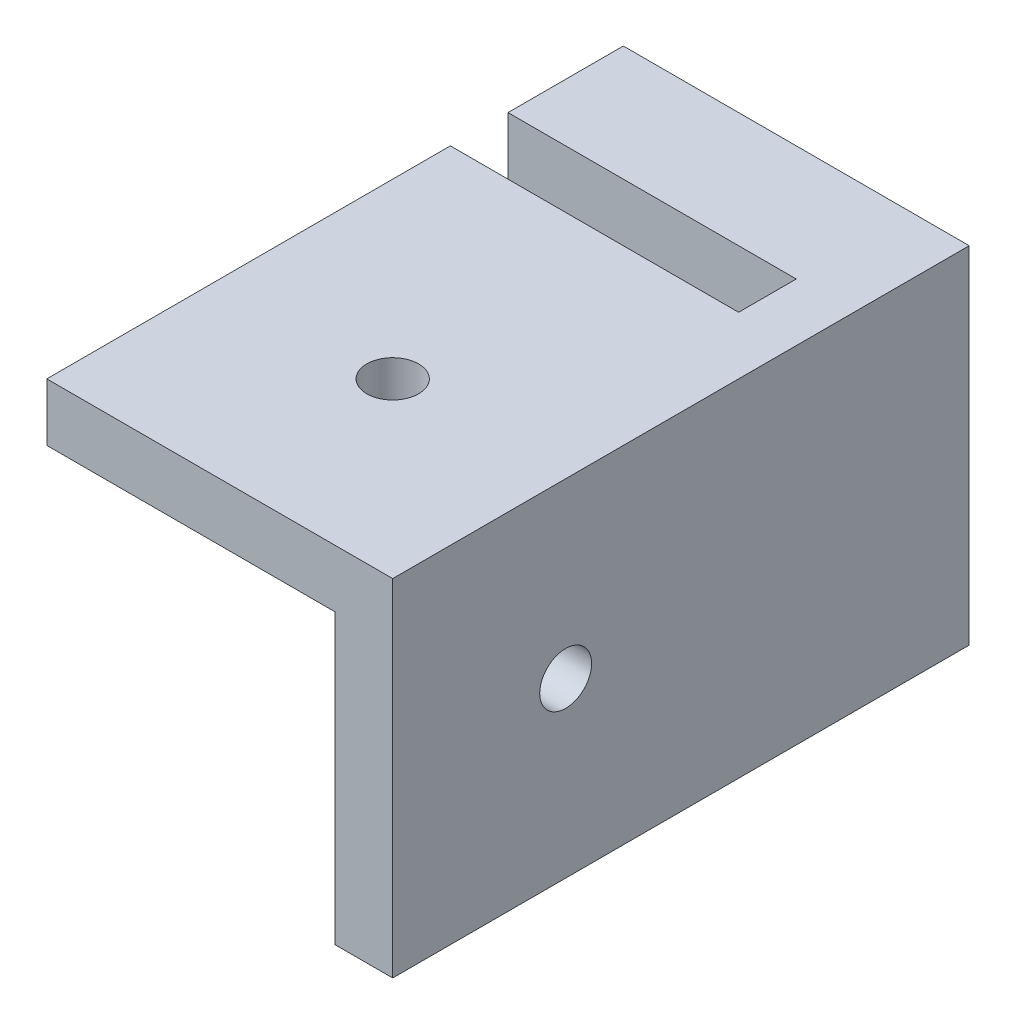
ISO-10303-21;
HEADER;
FILE_DESCRIPTION(('STEP AP214'),'2;1');
FILE_NAME('part.step','',(''),(''),'','','');
FILE_SCHEMA(('AUTOMOTIVE_DESIGN { 1 0 10303 214 1 1 1 1 }'));
ENDSEC;
DATA;
#1=APPLICATION_CONTEXT('core data for automotive mechanical design processes');
#2=APPLICATION_PROTOCOL_DEFINITION('international standard','automotive_design',2000,#1);
#3=PRODUCT_CONTEXT('',#1,'mechanical');
#4=PRODUCT('Part','Part','',(#3));
#5=PRODUCT_RELATED_PRODUCT_CATEGORY('part','',(#4));
#6=PRODUCT_DEFINITION_FORMATION('','',#4);
#7=PRODUCT_DEFINITION_CONTEXT('part definition',#1,'design');
#8=PRODUCT_DEFINITION('design','',#6,#7);
#9=PRODUCT_DEFINITION_SHAPE('','',#8);
#10=(LENGTH_UNIT() NAMED_UNIT(*) SI_UNIT(.MILLI.,.METRE.));
#11=(NAMED_UNIT(*) PLANE_ANGLE_UNIT() SI_UNIT($,.RADIAN.));
#12=(NAMED_UNIT(*) SI_UNIT($,.STERADIAN.) SOLID_ANGLE_UNIT());
#13=UNCERTAINTY_MEASURE_WITH_UNIT(LENGTH_MEASURE(1.E-05),#10,'distance_accuracy_value','');
#14=(GEOMETRIC_REPRESENTATION_CONTEXT(3) GLOBAL_UNCERTAINTY_ASSIGNED_CONTEXT((#13)) GLOBAL_UNIT_ASSIGNED_CONTEXT((#10,
#11,#12)) REPRESENTATION_CONTEXT('',''));
#15=CARTESIAN_POINT('',(0.,0.,0.));
#16=DIRECTION('',(0.,0.,1.));
#17=DIRECTION('',(1.,0.,0.));
#18=AXIS2_PLACEMENT_3D('',#15,#16,#17);
#19=CARTESIAN_POINT('',(-30.,0.,50.));
#20=DIRECTION('',(1.,0.,0.));
#21=DIRECTION('',(0.,0.,-1.));
#22=AXIS2_PLACEMENT_3D('',#19,#20,#21);
#23=PLANE('',#22);
#24=DIRECTION('',(0.,0.,-1.));
#25=VECTOR('',#24,1.);
#26=CARTESIAN_POINT('',(-30.,0.,50.));
#27=LINE('',#26,#25);
#28=CARTESIAN_POINT('',(-30.,0.,10.));
#29=VERTEX_POINT('',#28);
#30=CARTESIAN_POINT('',(-30.,0.,0.));
#31=VERTEX_POINT('',#30);
#32=EDGE_CURVE('E203',#29,#31,#27,.T.);
#33=ORIENTED_EDGE('',*,*,#32,.F.);
#34=DIRECTION('',(0.,1.,0.));
#35=VECTOR('',#34,1.);
#36=CARTESIAN_POINT('',(-30.,0.,10.));
#37=LINE('',#36,#35);
#38=CARTESIAN_POINT('',(-30.,30.,10.));
#39=VERTEX_POINT('',#38);
#40=EDGE_CURVE('E172',#29,#39,#37,.T.);
#41=ORIENTED_EDGE('',*,*,#40,.T.);
#42=DIRECTION('',(0.,0.,-1.));
#43=VECTOR('',#42,1.);
#44=CARTESIAN_POINT('',(-30.,30.,50.));
#45=LINE('',#44,#43);
#46=CARTESIAN_POINT('',(-30.,30.,0.));
#47=VERTEX_POINT('',#46);
#48=EDGE_CURVE('E205',#39,#47,#45,.T.);
#49=ORIENTED_EDGE('',*,*,#48,.T.);
#50=DIRECTION('',(0.,-1.,0.));
#51=VECTOR('',#50,1.);
#52=CARTESIAN_POINT('',(-30.,0.,0.));
#53=LINE('',#52,#51);
#54=EDGE_CURVE('E197',#47,#31,#53,.T.);
#55=ORIENTED_EDGE('',*,*,#54,.T.);
#56=EDGE_LOOP('',(#33,#41,#49,#55));
#57=FACE_BOUND('',#56,.T.);
#58=ADVANCED_FACE('F36',(#57),#23,.F.);
#59=CARTESIAN_POINT('',(0.,0.,50.));
#60=DIRECTION('',(-1.,0.,0.));
#61=DIRECTION('',(0.,0.,1.));
#62=AXIS2_PLACEMENT_3D('',#59,#60,#61);
#63=PLANE('',#62);
#64=CARTESIAN_POINT('',(0.,15.,35.));
#65=DIRECTION('',(-1.,0.,0.));
#66=DIRECTION('',(0.,0.,1.));
#67=AXIS2_PLACEMENT_3D('',#64,#65,#66);
#68=CIRCLE('',#67,2.25);
#69=CARTESIAN_POINT('',(0.,15.,37.25));
#70=VERTEX_POINT('',#69);
#71=EDGE_CURVE('E267',#70,#70,#68,.T.);
#72=ORIENTED_EDGE('',*,*,#71,.T.);
#73=EDGE_LOOP('',(#72));
#74=FACE_BOUND('',#73,.T.);
#75=DIRECTION('',(0.,1.,0.));
#76=VECTOR('',#75,1.);
#77=CARTESIAN_POINT('',(0.,0.,0.));
#78=LINE('',#77,#76);
#79=CARTESIAN_POINT('',(0.,0.,0.));
#80=VERTEX_POINT('',#79);
#81=CARTESIAN_POINT('',(0.,30.,0.));
#82=VERTEX_POINT('',#81);
#83=EDGE_CURVE('E175',#80,#82,#78,.T.);
#84=ORIENTED_EDGE('',*,*,#83,.T.);
#85=DIRECTION('',(0.,0.,-1.));
#86=VECTOR('',#85,1.);
#87=CARTESIAN_POINT('',(0.,30.,50.));
#88=LINE('',#87,#86);
#89=CARTESIAN_POINT('',(0.,30.,50.));
#90=VERTEX_POINT('',#89);
#91=EDGE_CURVE('E11',#90,#82,#88,.T.);
#92=ORIENTED_EDGE('',*,*,#91,.F.);
#93=DIRECTION('',(0.,1.,0.));
#94=VECTOR('',#93,1.);
#95=CARTESIAN_POINT('',(0.,0.,50.));
#96=LINE('',#95,#94);
#97=CARTESIAN_POINT('',(0.,0.,50.));
#98=VERTEX_POINT('',#97);
#99=EDGE_CURVE('E181',#98,#90,#96,.T.);
#100=ORIENTED_EDGE('',*,*,#99,.F.);
#101=DIRECTION('',(0.,0.,-1.));
#102=VECTOR('',#101,1.);
#103=CARTESIAN_POINT('',(0.,0.,50.));
#104=LINE('',#103,#102);
#105=EDGE_CURVE('E191',#98,#80,#104,.T.);
#106=ORIENTED_EDGE('',*,*,#105,.T.);
#107=EDGE_LOOP('',(#84,#92,#100,#106));
#108=FACE_BOUND('',#107,.T.);
#109=ADVANCED_FACE('F38',(#74,#108),#63,.F.);
#110=CARTESIAN_POINT('',(0.,30.,50.));
#111=DIRECTION('',(0.,-1.,0.));
#112=DIRECTION('',(1.,0.,0.));
#113=AXIS2_PLACEMENT_3D('',#110,#111,#112);
#114=PLANE('',#113);
#115=CARTESIAN_POINT('',(-15.,30.,35.));
#116=DIRECTION('',(0.,-1.,0.));
#117=DIRECTION('',(0.,0.,-1.));
#118=AXIS2_PLACEMENT_3D('',#115,#116,#117);
#119=CIRCLE('',#118,2.25);
#120=CARTESIAN_POINT('',(-15.,30.,32.75));
#121=VERTEX_POINT('',#120);
#122=EDGE_CURVE('E145',#121,#121,#119,.T.);
#123=ORIENTED_EDGE('',*,*,#122,.T.);
#124=EDGE_LOOP('',(#123));
#125=FACE_BOUND('',#124,.T.);
#126=ORIENTED_EDGE('',*,*,#48,.F.);
#127=DIRECTION('',(-1.,0.,0.));
#128=VECTOR('',#127,1.);
#129=CARTESIAN_POINT('',(-30.,30.,10.));
#130=LINE('',#129,#128);
#131=CARTESIAN_POINT('',(-5.,30.,10.));
#132=VERTEX_POINT('',#131);
#133=EDGE_CURVE('E160',#132,#39,#130,.T.);
#134=ORIENTED_EDGE('',*,*,#133,.F.);
#135=DIRECTION('',(0.,0.,-1.));
#136=VECTOR('',#135,1.);
#137=CARTESIAN_POINT('',(-5.,30.,10.));
#138=LINE('',#137,#136);
#139=CARTESIAN_POINT('',(-5.,30.,15.));
#140=VERTEX_POINT('',#139);
#141=EDGE_CURVE('E168',#140,#132,#138,.T.);
#142=ORIENTED_EDGE('',*,*,#141,.F.);
#143=DIRECTION('',(1.,0.,0.));
#144=VECTOR('',#143,1.);
#145=CARTESIAN_POINT('',(-30.,30.,15.));
#146=LINE('',#145,#144);
#147=CARTESIAN_POINT('',(-30.,30.,15.));
#148=VERTEX_POINT('',#147);
#149=EDGE_CURVE('E155',#148,#140,#146,.T.);
#150=ORIENTED_EDGE('',*,*,#149,.F.);
#151=CARTESIAN_POINT('',(-30.,30.,50.));
#152=VERTEX_POINT('',#151);
#153=EDGE_CURVE('E44',#152,#148,#45,.T.);
#154=ORIENTED_EDGE('',*,*,#153,.F.);
#155=DIRECTION('',(-1.,0.,0.));
#156=VECTOR('',#155,1.);
#157=CARTESIAN_POINT('',(0.,30.,50.));
#158=LINE('',#157,#156);
#159=EDGE_CURVE('E184',#90,#152,#158,.T.);
#160=ORIENTED_EDGE('',*,*,#159,.F.);
#161=ORIENTED_EDGE('',*,*,#91,.T.);
#162=DIRECTION('',(-1.,0.,0.));
#163=VECTOR('',#162,1.);
#164=CARTESIAN_POINT('',(0.,30.,0.));
#165=LINE('',#164,#163);
#166=EDGE_CURVE('E194',#82,#47,#165,.T.);
#167=ORIENTED_EDGE('',*,*,#166,.T.);
#168=EDGE_LOOP('',(#126,#134,#142,#150,#154,#160,#161,#167));
#169=FACE_BOUND('',#168,.T.);
#170=ADVANCED_FACE('F218',(#125,#169),#114,.F.);
#171=CARTESIAN_POINT('',(-30.,0.,25.));
#172=VERTEX_POINT('',#171);
#173=CARTESIAN_POINT('',(-30.,0.,15.));
#174=VERTEX_POINT('',#173);
#175=EDGE_CURVE('E204',#172,#174,#27,.T.);
#176=ORIENTED_EDGE('',*,*,#175,.F.);
#177=DIRECTION('',(0.,1.,0.));
#178=VECTOR('',#177,1.);
#179=CARTESIAN_POINT('',(-30.,0.,25.));
#180=LINE('',#179,#178);
#181=CARTESIAN_POINT('',(-30.,25.,25.));
#182=VERTEX_POINT('',#181);
#183=EDGE_CURVE('E126',#172,#182,#180,.T.);
#184=ORIENTED_EDGE('',*,*,#183,.T.);
#185=DIRECTION('',(0.,0.,1.));
#186=VECTOR('',#185,1.);
#187=CARTESIAN_POINT('',(-30.,25.,25.));
#188=LINE('',#187,#186);
#189=CARTESIAN_POINT('',(-30.,25.,50.));
#190=VERTEX_POINT('',#189);
#191=EDGE_CURVE('E142',#182,#190,#188,.T.);
#192=ORIENTED_EDGE('',*,*,#191,.T.);
#193=DIRECTION('',(0.,-1.,0.));
#194=VECTOR('',#193,1.);
#195=CARTESIAN_POINT('',(-30.,0.,50.));
#196=LINE('',#195,#194);
#197=EDGE_CURVE('E187',#152,#190,#196,.T.);
#198=ORIENTED_EDGE('',*,*,#197,.F.);
#199=ORIENTED_EDGE('',*,*,#153,.T.);
#200=DIRECTION('',(0.,1.,0.));
#201=VECTOR('',#200,1.);
#202=CARTESIAN_POINT('',(-30.,0.,15.));
#203=LINE('',#202,#201);
#204=EDGE_CURVE('E165',#174,#148,#203,.T.);
#205=ORIENTED_EDGE('',*,*,#204,.F.);
#206=EDGE_LOOP('',(#176,#184,#192,#198,#199,#205));
#207=FACE_BOUND('',#206,.T.);
#208=ADVANCED_FACE('F228',(#207),#23,.F.);
#209=CARTESIAN_POINT('',(0.,0.,50.));
#210=DIRECTION('',(0.,1.,0.));
#211=DIRECTION('',(-1.,0.,0.));
#212=AXIS2_PLACEMENT_3D('',#209,#210,#211);
#213=PLANE('',#212);
#214=DIRECTION('',(1.,0.,0.));
#215=VECTOR('',#214,1.);
#216=CARTESIAN_POINT('',(0.,0.,50.));
#217=LINE('',#216,#215);
#218=CARTESIAN_POINT('',(-5.,0.,50.));
#219=VERTEX_POINT('',#218);
#220=EDGE_CURVE('E138',#219,#98,#217,.T.);
#221=ORIENTED_EDGE('',*,*,#220,.F.);
#222=DIRECTION('',(0.,0.,-1.));
#223=VECTOR('',#222,1.);
#224=CARTESIAN_POINT('',(-5.,0.,25.));
#225=LINE('',#224,#223);
#226=CARTESIAN_POINT('',(-5.,0.,25.));
#227=VERTEX_POINT('',#226);
#228=EDGE_CURVE('E122',#219,#227,#225,.T.);
#229=ORIENTED_EDGE('',*,*,#228,.T.);
#230=DIRECTION('',(-1.,0.,0.));
#231=VECTOR('',#230,1.);
#232=CARTESIAN_POINT('',(-5.,0.,25.));
#233=LINE('',#232,#231);
#234=EDGE_CURVE('E127',#227,#172,#233,.T.);
#235=ORIENTED_EDGE('',*,*,#234,.T.);
#236=ORIENTED_EDGE('',*,*,#175,.T.);
#237=DIRECTION('',(1.,0.,0.));
#238=VECTOR('',#237,1.);
#239=CARTESIAN_POINT('',(-30.,0.,15.));
#240=LINE('',#239,#238);
#241=CARTESIAN_POINT('',(-5.,0.,15.));
#242=VERTEX_POINT('',#241);
#243=EDGE_CURVE('E157',#174,#242,#240,.T.);
#244=ORIENTED_EDGE('',*,*,#243,.T.);
#245=DIRECTION('',(0.,0.,-1.));
#246=VECTOR('',#245,1.);
#247=CARTESIAN_POINT('',(-5.,0.,10.));
#248=LINE('',#247,#246);
#249=CARTESIAN_POINT('',(-5.,0.,10.));
#250=VERTEX_POINT('',#249);
#251=EDGE_CURVE('E59',#242,#250,#248,.T.);
#252=ORIENTED_EDGE('',*,*,#251,.T.);
#253=DIRECTION('',(-1.,0.,0.));
#254=VECTOR('',#253,1.);
#255=CARTESIAN_POINT('',(-30.,0.,10.));
#256=LINE('',#255,#254);
#257=EDGE_CURVE('E162',#250,#29,#256,.T.);
#258=ORIENTED_EDGE('',*,*,#257,.T.);
#259=ORIENTED_EDGE('',*,*,#32,.T.);
#260=DIRECTION('',(1.,0.,0.));
#261=VECTOR('',#260,1.);
#262=CARTESIAN_POINT('',(0.,0.,0.));
#263=LINE('',#262,#261);
#264=EDGE_CURVE('E185',#31,#80,#263,.T.);
#265=ORIENTED_EDGE('',*,*,#264,.T.);
#266=ORIENTED_EDGE('',*,*,#105,.F.);
#267=EDGE_LOOP('',(#221,#229,#235,#236,#244,#252,#258,#259,#265,#266));
#268=FACE_BOUND('',#267,.T.);
#269=ADVANCED_FACE('F136',(#268),#213,.F.);
#270=CARTESIAN_POINT('',(0.,0.,50.));
#271=DIRECTION('',(0.,0.,1.));
#272=DIRECTION('',(1.,0.,0.));
#273=AXIS2_PLACEMENT_3D('',#270,#271,#272);
#274=PLANE('',#273);
#275=DIRECTION('',(0.,1.,0.));
#276=VECTOR('',#275,1.);
#277=CARTESIAN_POINT('',(-5.,0.,50.));
#278=LINE('',#277,#276);
#279=CARTESIAN_POINT('',(-5.,25.,50.));
#280=VERTEX_POINT('',#279);
#281=EDGE_CURVE('E153',#219,#280,#278,.T.);
#282=ORIENTED_EDGE('',*,*,#281,.F.);
#283=ORIENTED_EDGE('',*,*,#220,.T.);
#284=ORIENTED_EDGE('',*,*,#99,.T.);
#285=ORIENTED_EDGE('',*,*,#159,.T.);
#286=ORIENTED_EDGE('',*,*,#197,.T.);
#287=DIRECTION('',(1.,0.,0.));
#288=VECTOR('',#287,1.);
#289=CARTESIAN_POINT('',(-5.,25.,50.));
#290=LINE('',#289,#288);
#291=EDGE_CURVE('E139',#190,#280,#290,.T.);
#292=ORIENTED_EDGE('',*,*,#291,.T.);
#293=EDGE_LOOP('',(#282,#283,#284,#285,#286,#292));
#294=FACE_BOUND('',#293,.T.);
#295=ADVANCED_FACE('F226',(#294),#274,.T.);
#296=CARTESIAN_POINT('',(0.,0.,0.));
#297=DIRECTION('',(0.,0.,1.));
#298=DIRECTION('',(1.,0.,0.));
#299=AXIS2_PLACEMENT_3D('',#296,#297,#298);
#300=PLANE('',#299);
#301=ORIENTED_EDGE('',*,*,#83,.F.);
#302=ORIENTED_EDGE('',*,*,#264,.F.);
#303=ORIENTED_EDGE('',*,*,#54,.F.);
#304=ORIENTED_EDGE('',*,*,#166,.F.);
#305=EDGE_LOOP('',(#301,#302,#303,#304));
#306=FACE_BOUND('',#305,.T.);
#307=ADVANCED_FACE('F222',(#306),#300,.F.);
#308=CARTESIAN_POINT('',(-30.,0.,10.));
#309=DIRECTION('',(0.,0.,-1.));
#310=DIRECTION('',(-1.,0.,0.));
#311=AXIS2_PLACEMENT_3D('',#308,#309,#310);
#312=PLANE('',#311);
#313=ORIENTED_EDGE('',*,*,#133,.T.);
#314=ORIENTED_EDGE('',*,*,#40,.F.);
#315=ORIENTED_EDGE('',*,*,#257,.F.);
#316=DIRECTION('',(0.,1.,0.));
#317=VECTOR('',#316,1.);
#318=CARTESIAN_POINT('',(-5.,0.,10.));
#319=LINE('',#318,#317);
#320=EDGE_CURVE('E176',#250,#132,#319,.T.);
#321=ORIENTED_EDGE('',*,*,#320,.T.);
#322=EDGE_LOOP('',(#313,#314,#315,#321));
#323=FACE_BOUND('',#322,.T.);
#324=ADVANCED_FACE('F237',(#323),#312,.F.);
#325=CARTESIAN_POINT('',(-5.,0.,10.));
#326=DIRECTION('',(1.,0.,0.));
#327=DIRECTION('',(0.,0.,-1.));
#328=AXIS2_PLACEMENT_3D('',#325,#326,#327);
#329=PLANE('',#328);
#330=ORIENTED_EDGE('',*,*,#141,.T.);
#331=ORIENTED_EDGE('',*,*,#320,.F.);
#332=ORIENTED_EDGE('',*,*,#251,.F.);
#333=DIRECTION('',(0.,1.,0.));
#334=VECTOR('',#333,1.);
#335=CARTESIAN_POINT('',(-5.,0.,15.));
#336=LINE('',#335,#334);
#337=EDGE_CURVE('E178',#242,#140,#336,.T.);
#338=ORIENTED_EDGE('',*,*,#337,.T.);
#339=EDGE_LOOP('',(#330,#331,#332,#338));
#340=FACE_BOUND('',#339,.T.);
#341=ADVANCED_FACE('F234',(#340),#329,.F.);
#342=CARTESIAN_POINT('',(-30.,0.,15.));
#343=DIRECTION('',(0.,0.,1.));
#344=DIRECTION('',(1.,0.,0.));
#345=AXIS2_PLACEMENT_3D('',#342,#343,#344);
#346=PLANE('',#345);
#347=ORIENTED_EDGE('',*,*,#149,.T.);
#348=ORIENTED_EDGE('',*,*,#337,.F.);
#349=ORIENTED_EDGE('',*,*,#243,.F.);
#350=ORIENTED_EDGE('',*,*,#204,.T.);
#351=EDGE_LOOP('',(#347,#348,#349,#350));
#352=FACE_BOUND('',#351,.T.);
#353=ADVANCED_FACE('F231',(#352),#346,.F.);
#354=CARTESIAN_POINT('',(-5.,0.,25.));
#355=DIRECTION('',(1.,0.,0.));
#356=DIRECTION('',(0.,0.,-1.));
#357=AXIS2_PLACEMENT_3D('',#354,#355,#356);
#358=PLANE('',#357);
#359=CARTESIAN_POINT('',(-5.,15.,35.));
#360=DIRECTION('',(-1.,0.,0.));
#361=DIRECTION('',(0.,0.,1.));
#362=AXIS2_PLACEMENT_3D('',#359,#360,#361);
#363=CIRCLE('',#362,2.24999999999999);
#364=CARTESIAN_POINT('',(-5.,15.,37.25));
#365=VERTEX_POINT('',#364);
#366=EDGE_CURVE('E271',#365,#365,#363,.T.);
#367=ORIENTED_EDGE('',*,*,#366,.F.);
#368=EDGE_LOOP('',(#367));
#369=FACE_BOUND('',#368,.T.);
#370=DIRECTION('',(0.,0.,-1.));
#371=VECTOR('',#370,1.);
#372=CARTESIAN_POINT('',(-5.,25.,25.));
#373=LINE('',#372,#371);
#374=CARTESIAN_POINT('',(-5.,25.,25.));
#375=VERTEX_POINT('',#374);
#376=EDGE_CURVE('E51',#280,#375,#373,.T.);
#377=ORIENTED_EDGE('',*,*,#376,.T.);
#378=DIRECTION('',(0.,1.,0.));
#379=VECTOR('',#378,1.);
#380=CARTESIAN_POINT('',(-5.,0.,25.));
#381=LINE('',#380,#379);
#382=EDGE_CURVE('E118',#227,#375,#381,.T.);
#383=ORIENTED_EDGE('',*,*,#382,.F.);
#384=ORIENTED_EDGE('',*,*,#228,.F.);
#385=ORIENTED_EDGE('',*,*,#281,.T.);
#386=EDGE_LOOP('',(#377,#383,#384,#385));
#387=FACE_BOUND('',#386,.T.);
#388=ADVANCED_FACE('F120',(#369,#387),#358,.F.);
#389=CARTESIAN_POINT('',(-5.,0.,25.));
#390=DIRECTION('',(0.,0.,-1.));
#391=DIRECTION('',(-1.,0.,0.));
#392=AXIS2_PLACEMENT_3D('',#389,#390,#391);
#393=PLANE('',#392);
#394=DIRECTION('',(-1.,0.,0.));
#395=VECTOR('',#394,1.);
#396=CARTESIAN_POINT('',(-5.,25.,25.));
#397=LINE('',#396,#395);
#398=EDGE_CURVE('E149',#375,#182,#397,.T.);
#399=ORIENTED_EDGE('',*,*,#398,.T.);
#400=ORIENTED_EDGE('',*,*,#183,.F.);
#401=ORIENTED_EDGE('',*,*,#234,.F.);
#402=ORIENTED_EDGE('',*,*,#382,.T.);
#403=EDGE_LOOP('',(#399,#400,#401,#402));
#404=FACE_BOUND('',#403,.T.);
#405=ADVANCED_FACE('F130',(#404),#393,.F.);
#406=CARTESIAN_POINT('',(0.,25.,0.));
#407=DIRECTION('',(0.,-1.,0.));
#408=DIRECTION('',(0.,0.,-1.));
#409=AXIS2_PLACEMENT_3D('',#406,#407,#408);
#410=PLANE('',#409);
#411=CARTESIAN_POINT('',(-15.,25.,35.));
#412=DIRECTION('',(0.,-1.,0.));
#413=DIRECTION('',(0.,0.,-1.));
#414=AXIS2_PLACEMENT_3D('',#411,#412,#413);
#415=CIRCLE('',#414,2.24999999999999);
#416=CARTESIAN_POINT('',(-15.,25.,32.75));
#417=VERTEX_POINT('',#416);
#418=EDGE_CURVE('E265',#417,#417,#415,.T.);
#419=ORIENTED_EDGE('',*,*,#418,.F.);
#420=EDGE_LOOP('',(#419));
#421=FACE_BOUND('',#420,.T.);
#422=ORIENTED_EDGE('',*,*,#376,.F.);
#423=ORIENTED_EDGE('',*,*,#291,.F.);
#424=ORIENTED_EDGE('',*,*,#191,.F.);
#425=ORIENTED_EDGE('',*,*,#398,.F.);
#426=EDGE_LOOP('',(#422,#423,#424,#425));
#427=FACE_BOUND('',#426,.T.);
#428=ADVANCED_FACE('F227',(#421,#427),#410,.T.);
#429=CARTESIAN_POINT('',(-15.,25.,35.));
#430=DIRECTION('',(0.,-1.,0.));
#431=DIRECTION('',(0.,0.,-1.));
#432=AXIS2_PLACEMENT_3D('',#429,#430,#431);
#433=CYLINDRICAL_SURFACE('',#432,2.24999999999999);
#434=ORIENTED_EDGE('',*,*,#122,.F.);
#435=EDGE_LOOP('',(#434));
#436=FACE_BOUND('',#435,.T.);
#437=ORIENTED_EDGE('',*,*,#418,.T.);
#438=EDGE_LOOP('',(#437));
#439=FACE_BOUND('',#438,.T.);
#440=ADVANCED_FACE('F289',(#436,#439),#433,.F.);
#441=CARTESIAN_POINT('',(-5.,15.,35.));
#442=DIRECTION('',(-1.,0.,0.));
#443=DIRECTION('',(0.,0.,1.));
#444=AXIS2_PLACEMENT_3D('',#441,#442,#443);
#445=CYLINDRICAL_SURFACE('',#444,2.24999999999999);
#446=ORIENTED_EDGE('',*,*,#71,.F.);
#447=EDGE_LOOP('',(#446));
#448=FACE_BOUND('',#447,.T.);
#449=ORIENTED_EDGE('',*,*,#366,.T.);
#450=EDGE_LOOP('',(#449));
#451=FACE_BOUND('',#450,.T.);
#452=ADVANCED_FACE('F277',(#448,#451),#445,.F.);
#453=CLOSED_SHELL('',(#58,#109,#170,#208,#269,#295,#307,#324,#341,#353,#388,#405,#428,#440,#452));
#454=MANIFOLD_SOLID_BREP('B2',#453);
#455=ADVANCED_BREP_SHAPE_REPRESENTATION('',(#18,#454),#14);
#456=SHAPE_DEFINITION_REPRESENTATION(#9,#455);
ENDSEC;
END-ISO-10303-21;
